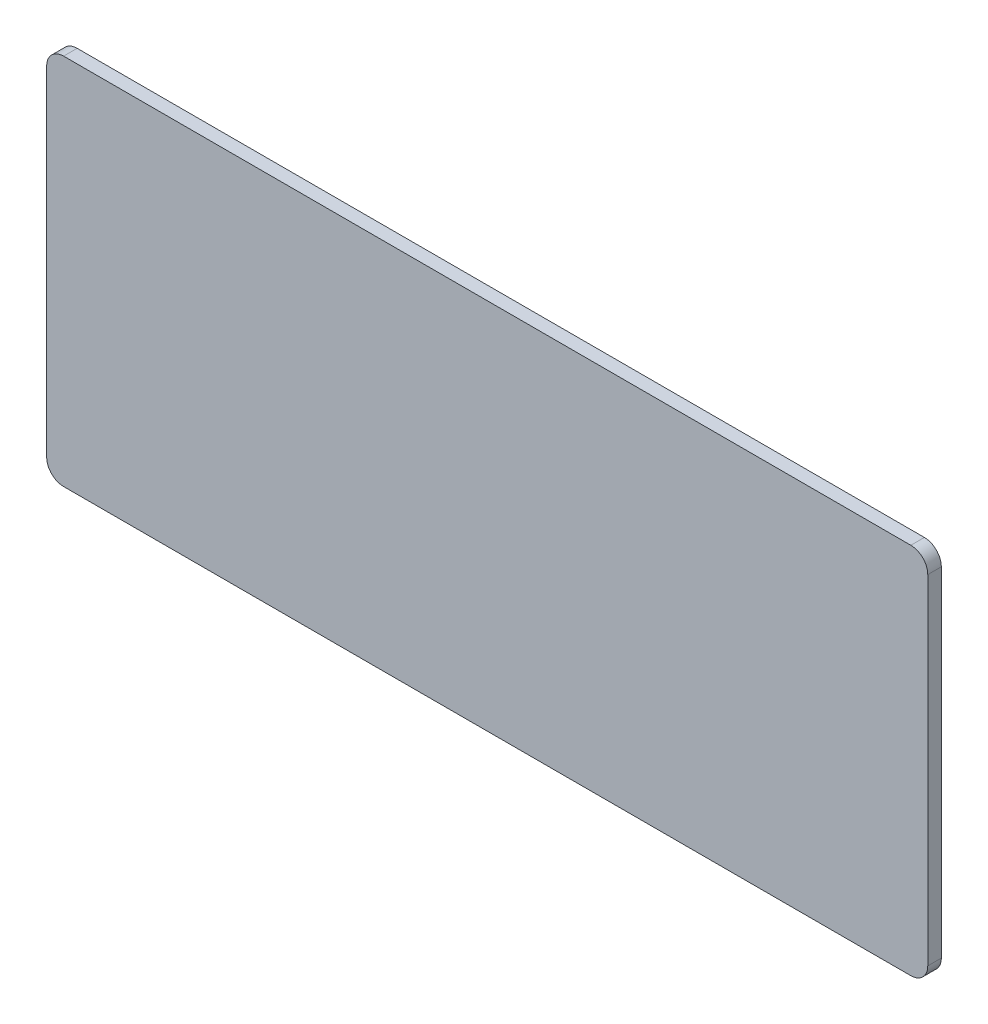
ISO-10303-21;
HEADER;
FILE_DESCRIPTION(('STEP AP214'),'2;1');
FILE_NAME('part.step','',(''),(''),'','','');
FILE_SCHEMA(('AUTOMOTIVE_DESIGN { 1 0 10303 214 1 1 1 1 }'));
ENDSEC;
DATA;
#1=APPLICATION_CONTEXT('core data for automotive mechanical design processes');
#2=APPLICATION_PROTOCOL_DEFINITION('international standard','automotive_design',2000,#1);
#3=PRODUCT_CONTEXT('',#1,'mechanical');
#4=PRODUCT('Part','Part','',(#3));
#5=PRODUCT_RELATED_PRODUCT_CATEGORY('part','',(#4));
#6=PRODUCT_DEFINITION_FORMATION('','',#4);
#7=PRODUCT_DEFINITION_CONTEXT('part definition',#1,'design');
#8=PRODUCT_DEFINITION('design','',#6,#7);
#9=PRODUCT_DEFINITION_SHAPE('','',#8);
#10=(LENGTH_UNIT() NAMED_UNIT(*) SI_UNIT(.MILLI.,.METRE.));
#11=(NAMED_UNIT(*) PLANE_ANGLE_UNIT() SI_UNIT($,.RADIAN.));
#12=(NAMED_UNIT(*) SI_UNIT($,.STERADIAN.) SOLID_ANGLE_UNIT());
#13=UNCERTAINTY_MEASURE_WITH_UNIT(LENGTH_MEASURE(1.E-05),#10,'distance_accuracy_value','');
#14=(GEOMETRIC_REPRESENTATION_CONTEXT(3) GLOBAL_UNCERTAINTY_ASSIGNED_CONTEXT((#13)) GLOBAL_UNIT_ASSIGNED_CONTEXT((#10,
#11,#12)) REPRESENTATION_CONTEXT('',''));
#15=CARTESIAN_POINT('',(0.,0.,0.));
#16=DIRECTION('',(0.,0.,1.));
#17=DIRECTION('',(1.,0.,0.));
#18=AXIS2_PLACEMENT_3D('',#15,#16,#17);
#19=CARTESIAN_POINT('',(-130.000000000002,-55.0000000000001,-3.99999999999989));
#20=DIRECTION('',(-1.00000000000001,0.,0.));
#21=DIRECTION('',(0.,0.,1.00000000000001));
#22=AXIS2_PLACEMENT_3D('',#19,#20,#21);
#23=PLANE('',#22);
#24=DIRECTION('',(0.,-1.,0.));
#25=VECTOR('',#24,1.);
#26=CARTESIAN_POINT('',(-130.000000000002,-55.0000000000001,-3.99999999999989));
#27=LINE('',#26,#25);
#28=CARTESIAN_POINT('',(-130.000000000001,50.0000000000006,-4.00000000000011));
#29=VERTEX_POINT('',#28);
#30=CARTESIAN_POINT('',(-130.000000000002,-50.,-3.99999999999989));
#31=VERTEX_POINT('',#30);
#32=EDGE_CURVE('E183',#29,#31,#27,.T.);
#33=ORIENTED_EDGE('',*,*,#32,.T.);
#34=DIRECTION('',(0.,0.,1.00000000000001));
#35=VECTOR('',#34,1.);
#36=CARTESIAN_POINT('',(-130.000000000002,-50.,-3.99999999999989));
#37=LINE('',#36,#35);
#38=CARTESIAN_POINT('',(-130.000000000002,-50.,1.11022302462516E-13));
#39=VERTEX_POINT('',#38);
#40=EDGE_CURVE('E11',#31,#39,#37,.T.);
#41=ORIENTED_EDGE('',*,*,#40,.T.);
#42=DIRECTION('',(0.,-1.,0.));
#43=VECTOR('',#42,1.);
#44=CARTESIAN_POINT('',(-130.000000000001,-55.0000000000001,1.11022302462516E-13));
#45=LINE('',#44,#43);
#46=CARTESIAN_POINT('',(-130.000000000002,50.0000000000007,3.33066907387547E-13));
#47=VERTEX_POINT('',#46);
#48=EDGE_CURVE('E113',#47,#39,#45,.T.);
#49=ORIENTED_EDGE('',*,*,#48,.F.);
#50=DIRECTION('',(0.,0.,1.00000000000001));
#51=VECTOR('',#50,1.);
#52=CARTESIAN_POINT('',(-130.000000000001,50.0000000000006,-4.00000000000011));
#53=LINE('',#52,#51);
#54=EDGE_CURVE('E49',#47,#29,#53,.F.);
#55=ORIENTED_EDGE('',*,*,#54,.T.);
#56=EDGE_LOOP('',(#33,#41,#49,#55));
#57=FACE_BOUND('',#56,.T.);
#58=ADVANCED_FACE('F40',(#57),#23,.T.);
#59=CARTESIAN_POINT('',(130.,55.,-3.99999999999712));
#60=DIRECTION('',(0.,1.,0.));
#61=DIRECTION('',(-1.00000000000001,0.,0.));
#62=AXIS2_PLACEMENT_3D('',#59,#60,#61);
#63=PLANE('',#62);
#64=DIRECTION('',(-1.00000000000001,0.,0.));
#65=VECTOR('',#64,1.);
#66=CARTESIAN_POINT('',(130.,54.9999999999999,2.99760216648792E-12));
#67=LINE('',#66,#65);
#68=CARTESIAN_POINT('',(125.,54.9999999999999,2.88657986402541E-12));
#69=VERTEX_POINT('',#68);
#70=CARTESIAN_POINT('',(-125.000000000002,54.9999999999999,2.22044604925031E-13));
#71=VERTEX_POINT('',#70);
#72=EDGE_CURVE('E145',#69,#71,#67,.T.);
#73=ORIENTED_EDGE('',*,*,#72,.F.);
#74=DIRECTION('',(0.,0.,1.00000000000001));
#75=VECTOR('',#74,1.);
#76=CARTESIAN_POINT('',(125.,55.,-3.99999999999712));
#77=LINE('',#76,#75);
#78=CARTESIAN_POINT('',(125.,55.,-3.99999999999712));
#79=VERTEX_POINT('',#78);
#80=EDGE_CURVE('E63',#69,#79,#77,.F.);
#81=ORIENTED_EDGE('',*,*,#80,.T.);
#82=DIRECTION('',(-1.00000000000001,0.,0.));
#83=VECTOR('',#82,1.);
#84=CARTESIAN_POINT('',(130.,55.,-3.99999999999712));
#85=LINE('',#84,#83);
#86=CARTESIAN_POINT('',(-125.000000000001,54.9999999999999,-3.99999999999989));
#87=VERTEX_POINT('',#86);
#88=EDGE_CURVE('E136',#79,#87,#85,.T.);
#89=ORIENTED_EDGE('',*,*,#88,.T.);
#90=DIRECTION('',(0.,0.,1.00000000000001));
#91=VECTOR('',#90,1.);
#92=CARTESIAN_POINT('',(-125.000000000001,54.9999999999999,-3.99999999999989));
#93=LINE('',#92,#91);
#94=EDGE_CURVE('E172',#87,#71,#93,.T.);
#95=ORIENTED_EDGE('',*,*,#94,.T.);
#96=EDGE_LOOP('',(#73,#81,#89,#95));
#97=FACE_BOUND('',#96,.T.);
#98=ADVANCED_FACE('F191',(#97),#63,.T.);
#99=CARTESIAN_POINT('',(130.,-55.0000000000001,-3.99999999999989));
#100=DIRECTION('',(1.00000000000001,0.,0.));
#101=DIRECTION('',(0.,0.,-1.00000000000001));
#102=AXIS2_PLACEMENT_3D('',#99,#100,#101);
#103=PLANE('',#102);
#104=DIRECTION('',(0.,1.,0.));
#105=VECTOR('',#104,1.);
#106=CARTESIAN_POINT('',(130.,-55.0000000000001,3.33066907387547E-13));
#107=LINE('',#106,#105);
#108=CARTESIAN_POINT('',(130.,-50.0000000000001,0.));
#109=VERTEX_POINT('',#108);
#110=CARTESIAN_POINT('',(130.,50.,3.21964677141295E-12));
#111=VERTEX_POINT('',#110);
#112=EDGE_CURVE('E130',#109,#111,#107,.T.);
#113=ORIENTED_EDGE('',*,*,#112,.F.);
#114=DIRECTION('',(0.,0.,1.00000000000001));
#115=VECTOR('',#114,1.);
#116=CARTESIAN_POINT('',(130.,-50.,-4.00000000000011));
#117=LINE('',#116,#115);
#118=CARTESIAN_POINT('',(130.,-50.,-4.00000000000011));
#119=VERTEX_POINT('',#118);
#120=EDGE_CURVE('E159',#109,#119,#117,.F.);
#121=ORIENTED_EDGE('',*,*,#120,.T.);
#122=DIRECTION('',(0.,1.,0.));
#123=VECTOR('',#122,1.);
#124=CARTESIAN_POINT('',(130.,-55.0000000000001,-3.99999999999989));
#125=LINE('',#124,#123);
#126=CARTESIAN_POINT('',(130.,50.,-3.99999999999701));
#127=VERTEX_POINT('',#126);
#128=EDGE_CURVE('E142',#119,#127,#125,.T.);
#129=ORIENTED_EDGE('',*,*,#128,.T.);
#130=DIRECTION('',(0.,0.,1.00000000000001));
#131=VECTOR('',#130,1.);
#132=CARTESIAN_POINT('',(130.,50.,-3.99999999999701));
#133=LINE('',#132,#131);
#134=EDGE_CURVE('E155',#127,#111,#133,.T.);
#135=ORIENTED_EDGE('',*,*,#134,.T.);
#136=EDGE_LOOP('',(#113,#121,#129,#135));
#137=FACE_BOUND('',#136,.T.);
#138=ADVANCED_FACE('F211',(#137),#103,.T.);
#139=CARTESIAN_POINT('',(130.,-55.0000000000001,-3.99999999999989));
#140=DIRECTION('',(0.,-1.,0.));
#141=DIRECTION('',(1.00000000000001,0.,0.));
#142=AXIS2_PLACEMENT_3D('',#139,#140,#141);
#143=PLANE('',#142);
#144=DIRECTION('',(1.00000000000001,0.,0.));
#145=VECTOR('',#144,1.);
#146=CARTESIAN_POINT('',(130.,-55.0000000000001,-3.99999999999989));
#147=LINE('',#146,#145);
#148=CARTESIAN_POINT('',(-125.000000000001,-55.,-3.99999999999978));
#149=VERTEX_POINT('',#148);
#150=CARTESIAN_POINT('',(125.,-55.0000000000001,-4.));
#151=VERTEX_POINT('',#150);
#152=EDGE_CURVE('E187',#149,#151,#147,.T.);
#153=ORIENTED_EDGE('',*,*,#152,.T.);
#154=DIRECTION('',(0.,0.,1.00000000000001));
#155=VECTOR('',#154,1.);
#156=CARTESIAN_POINT('',(125.,-55.0000000000001,-4.));
#157=LINE('',#156,#155);
#158=CARTESIAN_POINT('',(125.,-55.,1.11022302462516E-13));
#159=VERTEX_POINT('',#158);
#160=EDGE_CURVE('E128',#151,#159,#157,.T.);
#161=ORIENTED_EDGE('',*,*,#160,.T.);
#162=DIRECTION('',(1.00000000000001,0.,0.));
#163=VECTOR('',#162,1.);
#164=CARTESIAN_POINT('',(130.,-55.0000000000001,3.33066907387547E-13));
#165=LINE('',#164,#163);
#166=CARTESIAN_POINT('',(-125.000000000001,-55.0000000000001,0.));
#167=VERTEX_POINT('',#166);
#168=EDGE_CURVE('E111',#167,#159,#165,.T.);
#169=ORIENTED_EDGE('',*,*,#168,.F.);
#170=DIRECTION('',(0.,0.,1.00000000000001));
#171=VECTOR('',#170,1.);
#172=CARTESIAN_POINT('',(-125.000000000001,-55.,-3.99999999999978));
#173=LINE('',#172,#171);
#174=EDGE_CURVE('E125',#167,#149,#173,.F.);
#175=ORIENTED_EDGE('',*,*,#174,.T.);
#176=EDGE_LOOP('',(#153,#161,#169,#175));
#177=FACE_BOUND('',#176,.T.);
#178=ADVANCED_FACE('F124',(#177),#143,.T.);
#179=CARTESIAN_POINT('',(-1.66533453693773E-13,0.,-3.99999999999989));
#180=DIRECTION('',(0.,0.,1.00000000000001));
#181=DIRECTION('',(1.00000000000001,0.,0.));
#182=AXIS2_PLACEMENT_3D('',#179,#180,#181);
#183=PLANE('',#182);
#184=ORIENTED_EDGE('',*,*,#128,.F.);
#185=CARTESIAN_POINT('',(125.,-50.,-3.99999999999989));
#186=DIRECTION('',(0.,0.,1.00000000000001));
#187=DIRECTION('',(1.00000000000001,0.,0.));
#188=AXIS2_PLACEMENT_3D('',#185,#186,#187);
#189=CIRCLE('',#188,5.);
#190=EDGE_CURVE('E169',#119,#151,#189,.F.);
#191=ORIENTED_EDGE('',*,*,#190,.T.);
#192=ORIENTED_EDGE('',*,*,#152,.F.);
#193=CARTESIAN_POINT('',(-125.000000000001,-50.0000000000001,-3.99999999999978));
#194=DIRECTION('',(0.,0.,1.00000000000001));
#195=DIRECTION('',(1.00000000000001,0.,0.));
#196=AXIS2_PLACEMENT_3D('',#193,#194,#195);
#197=CIRCLE('',#196,5.);
#198=EDGE_CURVE('E134',#149,#31,#197,.F.);
#199=ORIENTED_EDGE('',*,*,#198,.T.);
#200=ORIENTED_EDGE('',*,*,#32,.F.);
#201=CARTESIAN_POINT('',(-125.000000000002,49.9999999999999,-4.00000000000011));
#202=DIRECTION('',(0.,0.,1.00000000000001));
#203=DIRECTION('',(1.00000000000001,0.,0.));
#204=AXIS2_PLACEMENT_3D('',#201,#202,#203);
#205=CIRCLE('',#204,5.);
#206=EDGE_CURVE('E56',#29,#87,#205,.F.);
#207=ORIENTED_EDGE('',*,*,#206,.T.);
#208=ORIENTED_EDGE('',*,*,#88,.F.);
#209=CARTESIAN_POINT('',(125.,50.,-3.99999999999701));
#210=DIRECTION('',(0.,0.,1.00000000000001));
#211=DIRECTION('',(1.00000000000001,0.,0.));
#212=AXIS2_PLACEMENT_3D('',#209,#210,#211);
#213=CIRCLE('',#212,5.);
#214=EDGE_CURVE('E166',#79,#127,#213,.F.);
#215=ORIENTED_EDGE('',*,*,#214,.T.);
#216=EDGE_LOOP('',(#184,#191,#192,#199,#200,#207,#208,#215));
#217=FACE_BOUND('',#216,.T.);
#218=ADVANCED_FACE('F186',(#217),#183,.F.);
#219=CARTESIAN_POINT('',(0.,0.,0.));
#220=DIRECTION('',(0.,0.,1.00000000000001));
#221=DIRECTION('',(1.00000000000001,0.,0.));
#222=AXIS2_PLACEMENT_3D('',#219,#220,#221);
#223=PLANE('',#222);
#224=ORIENTED_EDGE('',*,*,#168,.T.);
#225=CARTESIAN_POINT('',(125.,-50.0000000000001,1.11022302462516E-13));
#226=DIRECTION('',(0.,0.,1.00000000000001));
#227=DIRECTION('',(1.00000000000001,0.,0.));
#228=AXIS2_PLACEMENT_3D('',#225,#226,#227);
#229=CIRCLE('',#228,5.);
#230=EDGE_CURVE('E152',#159,#109,#229,.T.);
#231=ORIENTED_EDGE('',*,*,#230,.T.);
#232=ORIENTED_EDGE('',*,*,#112,.T.);
#233=CARTESIAN_POINT('',(125.,50.,2.99760216648792E-12));
#234=DIRECTION('',(0.,0.,1.00000000000001));
#235=DIRECTION('',(1.00000000000001,0.,0.));
#236=AXIS2_PLACEMENT_3D('',#233,#234,#235);
#237=CIRCLE('',#236,5.);
#238=EDGE_CURVE('E118',#111,#69,#237,.T.);
#239=ORIENTED_EDGE('',*,*,#238,.T.);
#240=ORIENTED_EDGE('',*,*,#72,.T.);
#241=CARTESIAN_POINT('',(-125.000000000002,49.9999999999999,1.11022302462516E-13));
#242=DIRECTION('',(0.,0.,1.00000000000001));
#243=DIRECTION('',(1.00000000000001,0.,0.));
#244=AXIS2_PLACEMENT_3D('',#241,#242,#243);
#245=CIRCLE('',#244,5.);
#246=EDGE_CURVE('E119',#71,#47,#245,.T.);
#247=ORIENTED_EDGE('',*,*,#246,.T.);
#248=ORIENTED_EDGE('',*,*,#48,.T.);
#249=CARTESIAN_POINT('',(-125.000000000002,-50.0000000000001,2.22044604925031E-13));
#250=DIRECTION('',(0.,0.,1.00000000000001));
#251=DIRECTION('',(1.00000000000001,0.,0.));
#252=AXIS2_PLACEMENT_3D('',#249,#250,#251);
#253=CIRCLE('',#252,5.);
#254=EDGE_CURVE('E108',#39,#167,#253,.T.);
#255=ORIENTED_EDGE('',*,*,#254,.T.);
#256=EDGE_LOOP('',(#224,#231,#232,#239,#240,#247,#248,#255));
#257=FACE_BOUND('',#256,.T.);
#258=ADVANCED_FACE('F110',(#257),#223,.T.);
#259=CARTESIAN_POINT('',(125.,-50.,-3.99999999999989));
#260=DIRECTION('',(0.,0.,1.00000000000001));
#261=DIRECTION('',(1.00000000000001,0.,0.));
#262=AXIS2_PLACEMENT_3D('',#259,#260,#261);
#263=CYLINDRICAL_SURFACE('',#262,5.);
#264=ORIENTED_EDGE('',*,*,#190,.F.);
#265=ORIENTED_EDGE('',*,*,#120,.F.);
#266=ORIENTED_EDGE('',*,*,#230,.F.);
#267=ORIENTED_EDGE('',*,*,#160,.F.);
#268=EDGE_LOOP('',(#264,#265,#266,#267));
#269=FACE_BOUND('',#268,.T.);
#270=ADVANCED_FACE('F208',(#269),#263,.T.);
#271=CARTESIAN_POINT('',(125.,50.,-3.99999999999701));
#272=DIRECTION('',(0.,0.,1.00000000000001));
#273=DIRECTION('',(1.00000000000001,0.,0.));
#274=AXIS2_PLACEMENT_3D('',#271,#272,#273);
#275=CYLINDRICAL_SURFACE('',#274,5.);
#276=ORIENTED_EDGE('',*,*,#214,.F.);
#277=ORIENTED_EDGE('',*,*,#80,.F.);
#278=ORIENTED_EDGE('',*,*,#238,.F.);
#279=ORIENTED_EDGE('',*,*,#134,.F.);
#280=EDGE_LOOP('',(#276,#277,#278,#279));
#281=FACE_BOUND('',#280,.T.);
#282=ADVANCED_FACE('F215',(#281),#275,.T.);
#283=CARTESIAN_POINT('',(-125.000000000001,-50.0000000000001,-3.99999999999978));
#284=DIRECTION('',(0.,0.,1.00000000000001));
#285=DIRECTION('',(1.00000000000001,0.,0.));
#286=AXIS2_PLACEMENT_3D('',#283,#284,#285);
#287=CYLINDRICAL_SURFACE('',#286,5.);
#288=ORIENTED_EDGE('',*,*,#198,.F.);
#289=ORIENTED_EDGE('',*,*,#174,.F.);
#290=ORIENTED_EDGE('',*,*,#254,.F.);
#291=ORIENTED_EDGE('',*,*,#40,.F.);
#292=EDGE_LOOP('',(#288,#289,#290,#291));
#293=FACE_BOUND('',#292,.T.);
#294=ADVANCED_FACE('F133',(#293),#287,.T.);
#295=CARTESIAN_POINT('',(-125.000000000002,49.9999999999999,-4.00000000000011));
#296=DIRECTION('',(0.,0.,1.00000000000001));
#297=DIRECTION('',(1.00000000000001,0.,0.));
#298=AXIS2_PLACEMENT_3D('',#295,#296,#297);
#299=CYLINDRICAL_SURFACE('',#298,5.);
#300=ORIENTED_EDGE('',*,*,#206,.F.);
#301=ORIENTED_EDGE('',*,*,#54,.F.);
#302=ORIENTED_EDGE('',*,*,#246,.F.);
#303=ORIENTED_EDGE('',*,*,#94,.F.);
#304=EDGE_LOOP('',(#300,#301,#302,#303));
#305=FACE_BOUND('',#304,.T.);
#306=ADVANCED_FACE('F42',(#305),#299,.T.);
#307=CLOSED_SHELL('',(#58,#98,#138,#178,#218,#258,#270,#282,#294,#306));
#308=MANIFOLD_SOLID_BREP('B2',#307);
#309=ADVANCED_BREP_SHAPE_REPRESENTATION('',(#18,#308),#14);
#310=SHAPE_DEFINITION_REPRESENTATION(#9,#309);
ENDSEC;
END-ISO-10303-21;
